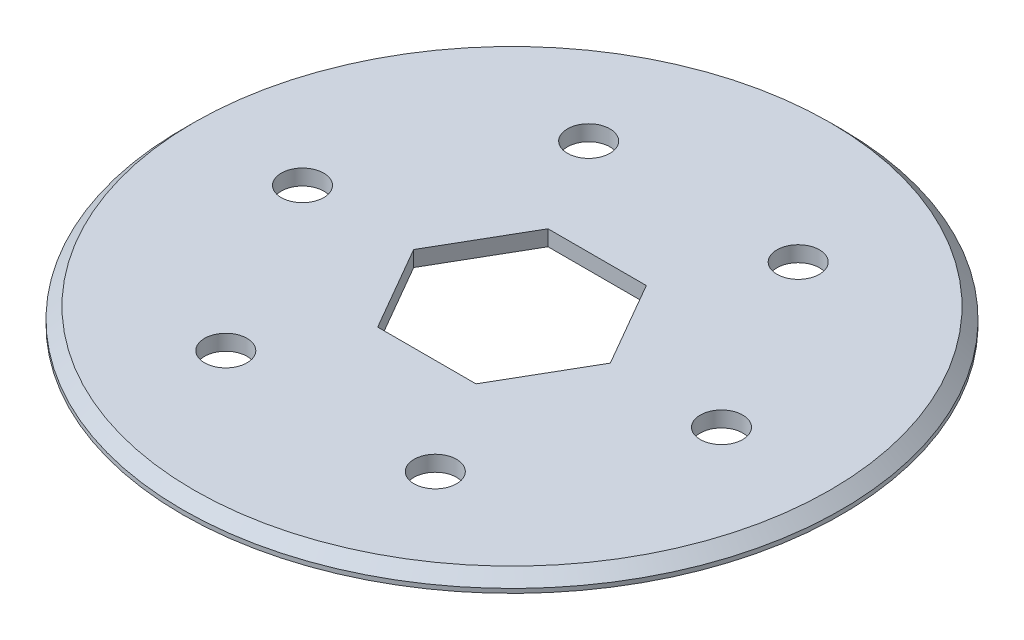
ISO-10303-21;
HEADER;
FILE_DESCRIPTION(('STEP AP214'),'2;1');
FILE_NAME('part.step','',(''),(''),'','','');
FILE_SCHEMA(('AUTOMOTIVE_DESIGN { 1 0 10303 214 1 1 1 1 }'));
ENDSEC;
DATA;
#1=APPLICATION_CONTEXT('core data for automotive mechanical design processes');
#2=APPLICATION_PROTOCOL_DEFINITION('international standard','automotive_design',2000,#1);
#3=PRODUCT_CONTEXT('',#1,'mechanical');
#4=PRODUCT('Part','Part','',(#3));
#5=PRODUCT_RELATED_PRODUCT_CATEGORY('part','',(#4));
#6=PRODUCT_DEFINITION_FORMATION('','',#4);
#7=PRODUCT_DEFINITION_CONTEXT('part definition',#1,'design');
#8=PRODUCT_DEFINITION('design','',#6,#7);
#9=PRODUCT_DEFINITION_SHAPE('','',#8);
#10=(LENGTH_UNIT() NAMED_UNIT(*) SI_UNIT(.MILLI.,.METRE.));
#11=(NAMED_UNIT(*) PLANE_ANGLE_UNIT() SI_UNIT($,.RADIAN.));
#12=(NAMED_UNIT(*) SI_UNIT($,.STERADIAN.) SOLID_ANGLE_UNIT());
#13=UNCERTAINTY_MEASURE_WITH_UNIT(LENGTH_MEASURE(1.E-05),#10,'distance_accuracy_value','');
#14=(GEOMETRIC_REPRESENTATION_CONTEXT(3) GLOBAL_UNCERTAINTY_ASSIGNED_CONTEXT((#13)) GLOBAL_UNIT_ASSIGNED_CONTEXT((#10,
#11,#12)) REPRESENTATION_CONTEXT('',''));
#15=CARTESIAN_POINT('',(0.,0.,0.));
#16=DIRECTION('',(0.,0.,1.));
#17=DIRECTION('',(1.,0.,0.));
#18=AXIS2_PLACEMENT_3D('',#15,#16,#17);
#19=CARTESIAN_POINT('',(0.,0.480000000002558,0.));
#20=DIRECTION('',(0.,-1.,0.));
#21=DIRECTION('',(0.,0.,-1.));
#22=AXIS2_PLACEMENT_3D('',#19,#20,#21);
#23=CONICAL_SURFACE('',#22,36.9570000000024,0.7853981633973);
#24=CARTESIAN_POINT('',(0.,0.480000000000112,0.));
#25=DIRECTION('',(0.,1.,0.));
#26=DIRECTION('',(0.,0.,1.));
#27=AXIS2_PLACEMENT_3D('',#24,#25,#26);
#28=CIRCLE('',#27,36.957);
#29=CARTESIAN_POINT('',(0.,0.480000000000112,36.957));
#30=VERTEX_POINT('',#29);
#31=EDGE_CURVE('E90',#30,#30,#28,.F.);
#32=ORIENTED_EDGE('',*,*,#31,.F.);
#33=EDGE_LOOP('',(#32));
#34=FACE_BOUND('',#33,.T.);
#35=CARTESIAN_POINT('',(0.,1.75000000000275,0.));
#36=DIRECTION('',(0.,-1.,0.));
#37=DIRECTION('',(0.,0.,-1.));
#38=AXIS2_PLACEMENT_3D('',#35,#36,#37);
#39=CIRCLE('',#38,35.6870000000026);
#40=CARTESIAN_POINT('',(0.,1.75000000000275,-35.6870000000026));
#41=VERTEX_POINT('',#40);
#42=EDGE_CURVE('E19',#41,#41,#39,.F.);
#43=ORIENTED_EDGE('',*,*,#42,.F.);
#44=EDGE_LOOP('',(#43));
#45=FACE_BOUND('',#44,.T.);
#46=ADVANCED_FACE('F16',(#34,#45),#23,.T.);
#47=CARTESIAN_POINT('',(0.,1.75000000000011,0.));
#48=DIRECTION('',(0.,1.,0.));
#49=DIRECTION('',(0.,0.,1.));
#50=AXIS2_PLACEMENT_3D('',#47,#48,#49);
#51=PLANE('',#50);
#52=DIRECTION('',(-1.,0.,0.));
#53=VECTOR('',#52,1.);
#54=CARTESIAN_POINT('',(5.51369507076154,1.75000000000011,9.5499999999999));
#55=LINE('',#54,#53);
#56=CARTESIAN_POINT('',(-5.51369507076154,1.75000000000011,9.5499999999999));
#57=VERTEX_POINT('',#56);
#58=CARTESIAN_POINT('',(5.51369507076162,1.75000000000011,9.54999999999995));
#59=VERTEX_POINT('',#58);
#60=EDGE_CURVE('E86',#57,#59,#55,.F.);
#61=ORIENTED_EDGE('',*,*,#60,.F.);
#62=DIRECTION('',(-0.500000000000017,0.,-0.866025403784429));
#63=VECTOR('',#62,1.);
#64=CARTESIAN_POINT('',(-5.51369507076154,1.75000000000011,9.5499999999999));
#65=LINE('',#64,#63);
#66=CARTESIAN_POINT('',(-11.027390141523,1.75000000000011,0.));
#67=VERTEX_POINT('',#66);
#68=EDGE_CURVE('E80',#67,#57,#65,.F.);
#69=ORIENTED_EDGE('',*,*,#68,.F.);
#70=DIRECTION('',(0.500000000000017,0.,-0.866025403784429));
#71=VECTOR('',#70,1.);
#72=CARTESIAN_POINT('',(-11.0273901415231,1.75000000000011,0.));
#73=LINE('',#72,#71);
#74=CARTESIAN_POINT('',(-5.51369507076162,1.75000000000011,-9.54999999999995));
#75=VERTEX_POINT('',#74);
#76=EDGE_CURVE('E71',#75,#67,#73,.F.);
#77=ORIENTED_EDGE('',*,*,#76,.F.);
#78=DIRECTION('',(1.,0.,0.));
#79=VECTOR('',#78,1.);
#80=CARTESIAN_POINT('',(-5.51369507076154,1.75000000000011,-9.5499999999999));
#81=LINE('',#80,#79);
#82=CARTESIAN_POINT('',(5.51369507076154,1.75000000000011,-9.5499999999999));
#83=VERTEX_POINT('',#82);
#84=EDGE_CURVE('E66',#83,#75,#81,.F.);
#85=ORIENTED_EDGE('',*,*,#84,.F.);
#86=DIRECTION('',(0.500000000000017,0.,0.866025403784429));
#87=VECTOR('',#86,1.);
#88=CARTESIAN_POINT('',(5.51369507076154,1.75000000000011,-9.5499999999999));
#89=LINE('',#88,#87);
#90=CARTESIAN_POINT('',(11.027390141523,1.75000000000011,0.));
#91=VERTEX_POINT('',#90);
#92=EDGE_CURVE('E150',#91,#83,#89,.F.);
#93=ORIENTED_EDGE('',*,*,#92,.F.);
#94=DIRECTION('',(-0.500000000000017,0.,0.866025403784429));
#95=VECTOR('',#94,1.);
#96=CARTESIAN_POINT('',(11.0273901415231,1.75000000000011,0.));
#97=LINE('',#96,#95);
#98=EDGE_CURVE('E146',#59,#91,#97,.F.);
#99=ORIENTED_EDGE('',*,*,#98,.F.);
#100=EDGE_LOOP('',(#61,#69,#77,#85,#93,#99));
#101=FACE_BOUND('',#100,.T.);
#102=CARTESIAN_POINT('',(11.7475,1.75000000000011,20.3472668619152));
#103=DIRECTION('',(0.,1.,0.));
#104=DIRECTION('',(0.,0.,1.));
#105=AXIS2_PLACEMENT_3D('',#102,#103,#104);
#106=CIRCLE('',#105,2.38125);
#107=CARTESIAN_POINT('',(11.7475,1.75000000000011,22.7285168619152));
#108=VERTEX_POINT('',#107);
#109=EDGE_CURVE('E119',#108,#108,#106,.F.);
#110=ORIENTED_EDGE('',*,*,#109,.T.);
#111=EDGE_LOOP('',(#110));
#112=FACE_BOUND('',#111,.T.);
#113=CARTESIAN_POINT('',(-11.7475,1.75000000000011,20.3472668619152));
#114=DIRECTION('',(0.,1.,0.));
#115=DIRECTION('',(0.,0.,1.));
#116=AXIS2_PLACEMENT_3D('',#113,#114,#115);
#117=CIRCLE('',#116,2.38125);
#118=CARTESIAN_POINT('',(-11.7475,1.75000000000011,22.7285168619152));
#119=VERTEX_POINT('',#118);
#120=EDGE_CURVE('E122',#119,#119,#117,.F.);
#121=ORIENTED_EDGE('',*,*,#120,.T.);
#122=EDGE_LOOP('',(#121));
#123=FACE_BOUND('',#122,.T.);
#124=CARTESIAN_POINT('',(-11.7475,1.75000000000011,-20.3472668619152));
#125=DIRECTION('',(0.,1.,0.));
#126=DIRECTION('',(0.,0.,1.));
#127=AXIS2_PLACEMENT_3D('',#124,#125,#126);
#128=CIRCLE('',#127,2.38125);
#129=CARTESIAN_POINT('',(-11.7475,1.75000000000011,-17.9660168619152));
#130=VERTEX_POINT('',#129);
#131=EDGE_CURVE('E125',#130,#130,#128,.F.);
#132=ORIENTED_EDGE('',*,*,#131,.T.);
#133=EDGE_LOOP('',(#132));
#134=FACE_BOUND('',#133,.T.);
#135=CARTESIAN_POINT('',(11.7475,1.75000000000011,-20.3472668619152));
#136=DIRECTION('',(0.,1.,0.));
#137=DIRECTION('',(0.,0.,1.));
#138=AXIS2_PLACEMENT_3D('',#135,#136,#137);
#139=CIRCLE('',#138,2.38125);
#140=CARTESIAN_POINT('',(11.7475,1.75000000000011,-17.9660168619152));
#141=VERTEX_POINT('',#140);
#142=EDGE_CURVE('E128',#141,#141,#139,.F.);
#143=ORIENTED_EDGE('',*,*,#142,.T.);
#144=EDGE_LOOP('',(#143));
#145=FACE_BOUND('',#144,.T.);
#146=CARTESIAN_POINT('',(-23.495,1.75000000000011,0.));
#147=DIRECTION('',(0.,1.,0.));
#148=DIRECTION('',(0.,0.,1.));
#149=AXIS2_PLACEMENT_3D('',#146,#147,#148);
#150=CIRCLE('',#149,2.38125);
#151=CARTESIAN_POINT('',(-23.495,1.75000000000011,2.38125));
#152=VERTEX_POINT('',#151);
#153=EDGE_CURVE('E131',#152,#152,#150,.F.);
#154=ORIENTED_EDGE('',*,*,#153,.T.);
#155=EDGE_LOOP('',(#154));
#156=FACE_BOUND('',#155,.T.);
#157=CARTESIAN_POINT('',(23.495,1.75000000000011,0.));
#158=DIRECTION('',(0.,1.,0.));
#159=DIRECTION('',(0.,0.,1.));
#160=AXIS2_PLACEMENT_3D('',#157,#158,#159);
#161=CIRCLE('',#160,2.38125);
#162=CARTESIAN_POINT('',(23.495,1.75000000000011,2.38125));
#163=VERTEX_POINT('',#162);
#164=EDGE_CURVE('E133',#163,#163,#161,.F.);
#165=ORIENTED_EDGE('',*,*,#164,.T.);
#166=EDGE_LOOP('',(#165));
#167=FACE_BOUND('',#166,.T.);
#168=ORIENTED_EDGE('',*,*,#42,.T.);
#169=EDGE_LOOP('',(#168));
#170=FACE_BOUND('',#169,.T.);
#171=ADVANCED_FACE('F83',(#101,#112,#123,#134,#145,#156,#167,#170),#51,.T.);
#172=CARTESIAN_POINT('',(0.,0.,0.));
#173=DIRECTION('',(0.,1.,0.));
#174=DIRECTION('',(0.,0.,1.));
#175=AXIS2_PLACEMENT_3D('',#172,#173,#174);
#176=CYLINDRICAL_SURFACE('',#175,36.957);
#177=CARTESIAN_POINT('',(0.,0.,0.));
#178=DIRECTION('',(0.,1.,0.));
#179=DIRECTION('',(0.,0.,1.));
#180=AXIS2_PLACEMENT_3D('',#177,#178,#179);
#181=CIRCLE('',#180,36.957);
#182=CARTESIAN_POINT('',(0.,0.,36.957));
#183=VERTEX_POINT('',#182);
#184=EDGE_CURVE('E116',#183,#183,#181,.T.);
#185=ORIENTED_EDGE('',*,*,#184,.T.);
#186=EDGE_LOOP('',(#185));
#187=FACE_BOUND('',#186,.T.);
#188=ORIENTED_EDGE('',*,*,#31,.T.);
#189=EDGE_LOOP('',(#188));
#190=FACE_BOUND('',#189,.T.);
#191=ADVANCED_FACE('F299',(#187,#190),#176,.T.);
#192=CARTESIAN_POINT('',(-5.51369507076154,0.,9.5499999999999));
#193=DIRECTION('',(0.866025403784429,0.,-0.500000000000017));
#194=DIRECTION('',(-0.500000000000017,0.,-0.866025403784429));
#195=AXIS2_PLACEMENT_3D('',#192,#193,#194);
#196=PLANE('',#195);
#197=DIRECTION('',(0.,1.,0.));
#198=VECTOR('',#197,1.);
#199=CARTESIAN_POINT('',(-5.51369507076154,0.,9.5499999999999));
#200=LINE('',#199,#198);
#201=CARTESIAN_POINT('',(-5.51369507076154,0.,9.5499999999999));
#202=VERTEX_POINT('',#201);
#203=EDGE_CURVE('E138',#202,#57,#200,.T.);
#204=ORIENTED_EDGE('',*,*,#203,.F.);
#205=DIRECTION('',(-0.500000000000046,0.,-0.866025403784412));
#206=VECTOR('',#205,1.);
#207=CARTESIAN_POINT('',(-5.51369507076154,0.,9.5499999999999));
#208=LINE('',#207,#206);
#209=CARTESIAN_POINT('',(-11.0273901415229,0.,0.));
#210=VERTEX_POINT('',#209);
#211=EDGE_CURVE('E94',#202,#210,#208,.T.);
#212=ORIENTED_EDGE('',*,*,#211,.T.);
#213=DIRECTION('',(0.,1.,0.));
#214=VECTOR('',#213,1.);
#215=CARTESIAN_POINT('',(-11.0273901415231,0.,0.));
#216=LINE('',#215,#214);
#217=EDGE_CURVE('E76',#67,#210,#216,.F.);
#218=ORIENTED_EDGE('',*,*,#217,.F.);
#219=ORIENTED_EDGE('',*,*,#68,.T.);
#220=EDGE_LOOP('',(#204,#212,#218,#219));
#221=FACE_BOUND('',#220,.T.);
#222=ADVANCED_FACE('F93',(#221),#196,.T.);
#223=CARTESIAN_POINT('',(-11.0273901415231,0.,0.));
#224=DIRECTION('',(0.866025403784429,0.,0.500000000000017));
#225=DIRECTION('',(0.500000000000017,0.,-0.866025403784429));
#226=AXIS2_PLACEMENT_3D('',#223,#224,#225);
#227=PLANE('',#226);
#228=ORIENTED_EDGE('',*,*,#217,.T.);
#229=DIRECTION('',(0.500000000000046,0.,-0.866025403784412));
#230=VECTOR('',#229,1.);
#231=CARTESIAN_POINT('',(-11.0273901415231,0.,0.));
#232=LINE('',#231,#230);
#233=CARTESIAN_POINT('',(-5.5136950707617,0.,-9.54999999999999));
#234=VERTEX_POINT('',#233);
#235=EDGE_CURVE('E160',#210,#234,#232,.T.);
#236=ORIENTED_EDGE('',*,*,#235,.T.);
#237=DIRECTION('',(0.,1.,0.));
#238=VECTOR('',#237,1.);
#239=CARTESIAN_POINT('',(-5.51369507076154,0.,-9.5499999999999));
#240=LINE('',#239,#238);
#241=EDGE_CURVE('E78',#75,#234,#240,.F.);
#242=ORIENTED_EDGE('',*,*,#241,.F.);
#243=ORIENTED_EDGE('',*,*,#76,.T.);
#244=EDGE_LOOP('',(#228,#236,#242,#243));
#245=FACE_BOUND('',#244,.T.);
#246=ADVANCED_FACE('F73',(#245),#227,.T.);
#247=CARTESIAN_POINT('',(-5.51369507076154,0.,-9.5499999999999));
#248=DIRECTION('',(0.,0.,1.));
#249=DIRECTION('',(1.,0.,0.));
#250=AXIS2_PLACEMENT_3D('',#247,#248,#249);
#251=PLANE('',#250);
#252=ORIENTED_EDGE('',*,*,#241,.T.);
#253=DIRECTION('',(1.,0.,0.));
#254=VECTOR('',#253,1.);
#255=CARTESIAN_POINT('',(0.,0.,-9.5499999999999));
#256=LINE('',#255,#254);
#257=CARTESIAN_POINT('',(5.51369507076154,0.,-9.5499999999999));
#258=VERTEX_POINT('',#257);
#259=EDGE_CURVE('E154',#234,#258,#256,.T.);
#260=ORIENTED_EDGE('',*,*,#259,.T.);
#261=DIRECTION('',(0.,1.,0.));
#262=VECTOR('',#261,1.);
#263=CARTESIAN_POINT('',(5.51369507076154,0.,-9.5499999999999));
#264=LINE('',#263,#262);
#265=EDGE_CURVE('E148',#83,#258,#264,.F.);
#266=ORIENTED_EDGE('',*,*,#265,.F.);
#267=ORIENTED_EDGE('',*,*,#84,.T.);
#268=EDGE_LOOP('',(#252,#260,#266,#267));
#269=FACE_BOUND('',#268,.T.);
#270=ADVANCED_FACE('F153',(#269),#251,.T.);
#271=CARTESIAN_POINT('',(5.51369507076154,0.,-9.5499999999999));
#272=DIRECTION('',(-0.866025403784429,0.,0.500000000000017));
#273=DIRECTION('',(0.500000000000017,0.,0.866025403784429));
#274=AXIS2_PLACEMENT_3D('',#271,#272,#273);
#275=PLANE('',#274);
#276=ORIENTED_EDGE('',*,*,#265,.T.);
#277=DIRECTION('',(0.500000000000046,0.,0.866025403784412));
#278=VECTOR('',#277,1.);
#279=CARTESIAN_POINT('',(5.51369507076154,0.,-9.5499999999999));
#280=LINE('',#279,#278);
#281=CARTESIAN_POINT('',(11.0273901415229,0.,0.));
#282=VERTEX_POINT('',#281);
#283=EDGE_CURVE('E162',#258,#282,#280,.T.);
#284=ORIENTED_EDGE('',*,*,#283,.T.);
#285=DIRECTION('',(0.,1.,0.));
#286=VECTOR('',#285,1.);
#287=CARTESIAN_POINT('',(11.0273901415231,0.,0.));
#288=LINE('',#287,#286);
#289=EDGE_CURVE('E144',#91,#282,#288,.F.);
#290=ORIENTED_EDGE('',*,*,#289,.F.);
#291=ORIENTED_EDGE('',*,*,#92,.T.);
#292=EDGE_LOOP('',(#276,#284,#290,#291));
#293=FACE_BOUND('',#292,.T.);
#294=ADVANCED_FACE('F175',(#293),#275,.T.);
#295=CARTESIAN_POINT('',(11.0273901415231,0.,0.));
#296=DIRECTION('',(-0.866025403784429,0.,-0.500000000000017));
#297=DIRECTION('',(-0.500000000000017,0.,0.866025403784429));
#298=AXIS2_PLACEMENT_3D('',#295,#296,#297);
#299=PLANE('',#298);
#300=ORIENTED_EDGE('',*,*,#289,.T.);
#301=DIRECTION('',(-0.500000000000046,0.,0.866025403784412));
#302=VECTOR('',#301,1.);
#303=CARTESIAN_POINT('',(11.0273901415231,0.,0.));
#304=LINE('',#303,#302);
#305=CARTESIAN_POINT('',(5.5136950707617,0.,9.54999999999999));
#306=VERTEX_POINT('',#305);
#307=EDGE_CURVE('E166',#282,#306,#304,.T.);
#308=ORIENTED_EDGE('',*,*,#307,.T.);
#309=DIRECTION('',(0.,1.,0.));
#310=VECTOR('',#309,1.);
#311=CARTESIAN_POINT('',(5.51369507076154,0.,9.5499999999999));
#312=LINE('',#311,#310);
#313=EDGE_CURVE('E34',#59,#306,#312,.F.);
#314=ORIENTED_EDGE('',*,*,#313,.F.);
#315=ORIENTED_EDGE('',*,*,#98,.T.);
#316=EDGE_LOOP('',(#300,#308,#314,#315));
#317=FACE_BOUND('',#316,.T.);
#318=ADVANCED_FACE('F171',(#317),#299,.T.);
#319=CARTESIAN_POINT('',(5.51369507076154,0.,9.5499999999999));
#320=DIRECTION('',(0.,0.,-1.));
#321=DIRECTION('',(-1.,0.,0.));
#322=AXIS2_PLACEMENT_3D('',#319,#320,#321);
#323=PLANE('',#322);
#324=ORIENTED_EDGE('',*,*,#313,.T.);
#325=DIRECTION('',(1.,0.,0.));
#326=VECTOR('',#325,1.);
#327=CARTESIAN_POINT('',(0.,0.,9.5499999999999));
#328=LINE('',#327,#326);
#329=EDGE_CURVE('E115',#306,#202,#328,.F.);
#330=ORIENTED_EDGE('',*,*,#329,.T.);
#331=ORIENTED_EDGE('',*,*,#203,.T.);
#332=ORIENTED_EDGE('',*,*,#60,.T.);
#333=EDGE_LOOP('',(#324,#330,#331,#332));
#334=FACE_BOUND('',#333,.T.);
#335=ADVANCED_FACE('F169',(#334),#323,.T.);
#336=CARTESIAN_POINT('',(23.495,0.,0.));
#337=DIRECTION('',(0.,1.,0.));
#338=DIRECTION('',(0.,0.,1.));
#339=AXIS2_PLACEMENT_3D('',#336,#337,#338);
#340=CYLINDRICAL_SURFACE('',#339,2.38125);
#341=ORIENTED_EDGE('',*,*,#164,.F.);
#342=EDGE_LOOP('',(#341));
#343=FACE_BOUND('',#342,.T.);
#344=CARTESIAN_POINT('',(23.495,0.,0.));
#345=DIRECTION('',(0.,1.,0.));
#346=DIRECTION('',(0.,0.,1.));
#347=AXIS2_PLACEMENT_3D('',#344,#345,#346);
#348=CIRCLE('',#347,2.38125);
#349=CARTESIAN_POINT('',(23.495,0.,2.38125));
#350=VERTEX_POINT('',#349);
#351=EDGE_CURVE('E112',#350,#350,#348,.F.);
#352=ORIENTED_EDGE('',*,*,#351,.T.);
#353=EDGE_LOOP('',(#352));
#354=FACE_BOUND('',#353,.T.);
#355=ADVANCED_FACE('F212',(#343,#354),#340,.F.);
#356=CARTESIAN_POINT('',(-23.495,0.,0.));
#357=DIRECTION('',(0.,1.,0.));
#358=DIRECTION('',(0.,0.,1.));
#359=AXIS2_PLACEMENT_3D('',#356,#357,#358);
#360=CYLINDRICAL_SURFACE('',#359,2.38125);
#361=ORIENTED_EDGE('',*,*,#153,.F.);
#362=EDGE_LOOP('',(#361));
#363=FACE_BOUND('',#362,.T.);
#364=CARTESIAN_POINT('',(-23.495,0.,0.));
#365=DIRECTION('',(0.,1.,0.));
#366=DIRECTION('',(0.,0.,1.));
#367=AXIS2_PLACEMENT_3D('',#364,#365,#366);
#368=CIRCLE('',#367,2.38125);
#369=CARTESIAN_POINT('',(-23.495,0.,2.38125));
#370=VERTEX_POINT('',#369);
#371=EDGE_CURVE('E109',#370,#370,#368,.F.);
#372=ORIENTED_EDGE('',*,*,#371,.T.);
#373=EDGE_LOOP('',(#372));
#374=FACE_BOUND('',#373,.T.);
#375=ADVANCED_FACE('F208',(#363,#374),#360,.F.);
#376=CARTESIAN_POINT('',(11.7475,0.,-20.3472668619152));
#377=DIRECTION('',(0.,1.,0.));
#378=DIRECTION('',(0.,0.,1.));
#379=AXIS2_PLACEMENT_3D('',#376,#377,#378);
#380=CYLINDRICAL_SURFACE('',#379,2.38125);
#381=ORIENTED_EDGE('',*,*,#142,.F.);
#382=EDGE_LOOP('',(#381));
#383=FACE_BOUND('',#382,.T.);
#384=CARTESIAN_POINT('',(11.7475,0.,-20.3472668619152));
#385=DIRECTION('',(0.,1.,0.));
#386=DIRECTION('',(0.,0.,1.));
#387=AXIS2_PLACEMENT_3D('',#384,#385,#386);
#388=CIRCLE('',#387,2.38125);
#389=CARTESIAN_POINT('',(11.7475,0.,-17.9660168619152));
#390=VERTEX_POINT('',#389);
#391=EDGE_CURVE('E106',#390,#390,#388,.F.);
#392=ORIENTED_EDGE('',*,*,#391,.T.);
#393=EDGE_LOOP('',(#392));
#394=FACE_BOUND('',#393,.T.);
#395=ADVANCED_FACE('F204',(#383,#394),#380,.F.);
#396=CARTESIAN_POINT('',(-11.7475,0.,-20.3472668619152));
#397=DIRECTION('',(0.,1.,0.));
#398=DIRECTION('',(0.,0.,1.));
#399=AXIS2_PLACEMENT_3D('',#396,#397,#398);
#400=CYLINDRICAL_SURFACE('',#399,2.38125);
#401=ORIENTED_EDGE('',*,*,#131,.F.);
#402=EDGE_LOOP('',(#401));
#403=FACE_BOUND('',#402,.T.);
#404=CARTESIAN_POINT('',(-11.7475,0.,-20.3472668619152));
#405=DIRECTION('',(0.,1.,0.));
#406=DIRECTION('',(0.,0.,1.));
#407=AXIS2_PLACEMENT_3D('',#404,#405,#406);
#408=CIRCLE('',#407,2.38125);
#409=CARTESIAN_POINT('',(-11.7475,0.,-17.9660168619152));
#410=VERTEX_POINT('',#409);
#411=EDGE_CURVE('E103',#410,#410,#408,.F.);
#412=ORIENTED_EDGE('',*,*,#411,.T.);
#413=EDGE_LOOP('',(#412));
#414=FACE_BOUND('',#413,.T.);
#415=ADVANCED_FACE('F200',(#403,#414),#400,.F.);
#416=CARTESIAN_POINT('',(-11.7475,0.,20.3472668619152));
#417=DIRECTION('',(0.,1.,0.));
#418=DIRECTION('',(0.,0.,1.));
#419=AXIS2_PLACEMENT_3D('',#416,#417,#418);
#420=CYLINDRICAL_SURFACE('',#419,2.38125);
#421=ORIENTED_EDGE('',*,*,#120,.F.);
#422=EDGE_LOOP('',(#421));
#423=FACE_BOUND('',#422,.T.);
#424=CARTESIAN_POINT('',(-11.7475,0.,20.3472668619152));
#425=DIRECTION('',(0.,1.,0.));
#426=DIRECTION('',(0.,0.,1.));
#427=AXIS2_PLACEMENT_3D('',#424,#425,#426);
#428=CIRCLE('',#427,2.38125);
#429=CARTESIAN_POINT('',(-11.7475,0.,22.7285168619152));
#430=VERTEX_POINT('',#429);
#431=EDGE_CURVE('E25',#430,#430,#428,.F.);
#432=ORIENTED_EDGE('',*,*,#431,.T.);
#433=EDGE_LOOP('',(#432));
#434=FACE_BOUND('',#433,.T.);
#435=ADVANCED_FACE('F192',(#423,#434),#420,.F.);
#436=CARTESIAN_POINT('',(11.7475,0.,20.3472668619152));
#437=DIRECTION('',(0.,1.,0.));
#438=DIRECTION('',(0.,0.,1.));
#439=AXIS2_PLACEMENT_3D('',#436,#437,#438);
#440=CYLINDRICAL_SURFACE('',#439,2.38125);
#441=ORIENTED_EDGE('',*,*,#109,.F.);
#442=EDGE_LOOP('',(#441));
#443=FACE_BOUND('',#442,.T.);
#444=CARTESIAN_POINT('',(11.7475,0.,20.3472668619152));
#445=DIRECTION('',(0.,1.,0.));
#446=DIRECTION('',(0.,0.,1.));
#447=AXIS2_PLACEMENT_3D('',#444,#445,#446);
#448=CIRCLE('',#447,2.38125);
#449=CARTESIAN_POINT('',(11.7475,0.,22.7285168619152));
#450=VERTEX_POINT('',#449);
#451=EDGE_CURVE('E11',#450,#450,#448,.F.);
#452=ORIENTED_EDGE('',*,*,#451,.T.);
#453=EDGE_LOOP('',(#452));
#454=FACE_BOUND('',#453,.T.);
#455=ADVANCED_FACE('F186',(#443,#454),#440,.F.);
#456=CARTESIAN_POINT('',(0.,0.,0.));
#457=DIRECTION('',(0.,1.,0.));
#458=DIRECTION('',(0.,0.,1.));
#459=AXIS2_PLACEMENT_3D('',#456,#457,#458);
#460=PLANE('',#459);
#461=ORIENTED_EDGE('',*,*,#451,.F.);
#462=EDGE_LOOP('',(#461));
#463=FACE_BOUND('',#462,.T.);
#464=ORIENTED_EDGE('',*,*,#431,.F.);
#465=EDGE_LOOP('',(#464));
#466=FACE_BOUND('',#465,.T.);
#467=ORIENTED_EDGE('',*,*,#411,.F.);
#468=EDGE_LOOP('',(#467));
#469=FACE_BOUND('',#468,.T.);
#470=ORIENTED_EDGE('',*,*,#391,.F.);
#471=EDGE_LOOP('',(#470));
#472=FACE_BOUND('',#471,.T.);
#473=ORIENTED_EDGE('',*,*,#371,.F.);
#474=EDGE_LOOP('',(#473));
#475=FACE_BOUND('',#474,.T.);
#476=ORIENTED_EDGE('',*,*,#351,.F.);
#477=EDGE_LOOP('',(#476));
#478=FACE_BOUND('',#477,.T.);
#479=ORIENTED_EDGE('',*,*,#307,.F.);
#480=ORIENTED_EDGE('',*,*,#283,.F.);
#481=ORIENTED_EDGE('',*,*,#259,.F.);
#482=ORIENTED_EDGE('',*,*,#235,.F.);
#483=ORIENTED_EDGE('',*,*,#211,.F.);
#484=ORIENTED_EDGE('',*,*,#329,.F.);
#485=EDGE_LOOP('',(#479,#480,#481,#482,#483,#484));
#486=FACE_BOUND('',#485,.T.);
#487=ORIENTED_EDGE('',*,*,#184,.F.);
#488=EDGE_LOOP('',(#487));
#489=FACE_BOUND('',#488,.T.);
#490=ADVANCED_FACE('F158',(#463,#466,#469,#472,#475,#478,#486,#489),#460,.F.);
#491=CLOSED_SHELL('',(#46,#171,#191,#222,#246,#270,#294,#318,#335,#355,#375,#395,#415,#435,#455,#490));
#492=MANIFOLD_SOLID_BREP('B1',#491);
#493=ADVANCED_BREP_SHAPE_REPRESENTATION('',(#18,#492),#14);
#494=SHAPE_DEFINITION_REPRESENTATION(#9,#493);
ENDSEC;
END-ISO-10303-21;
